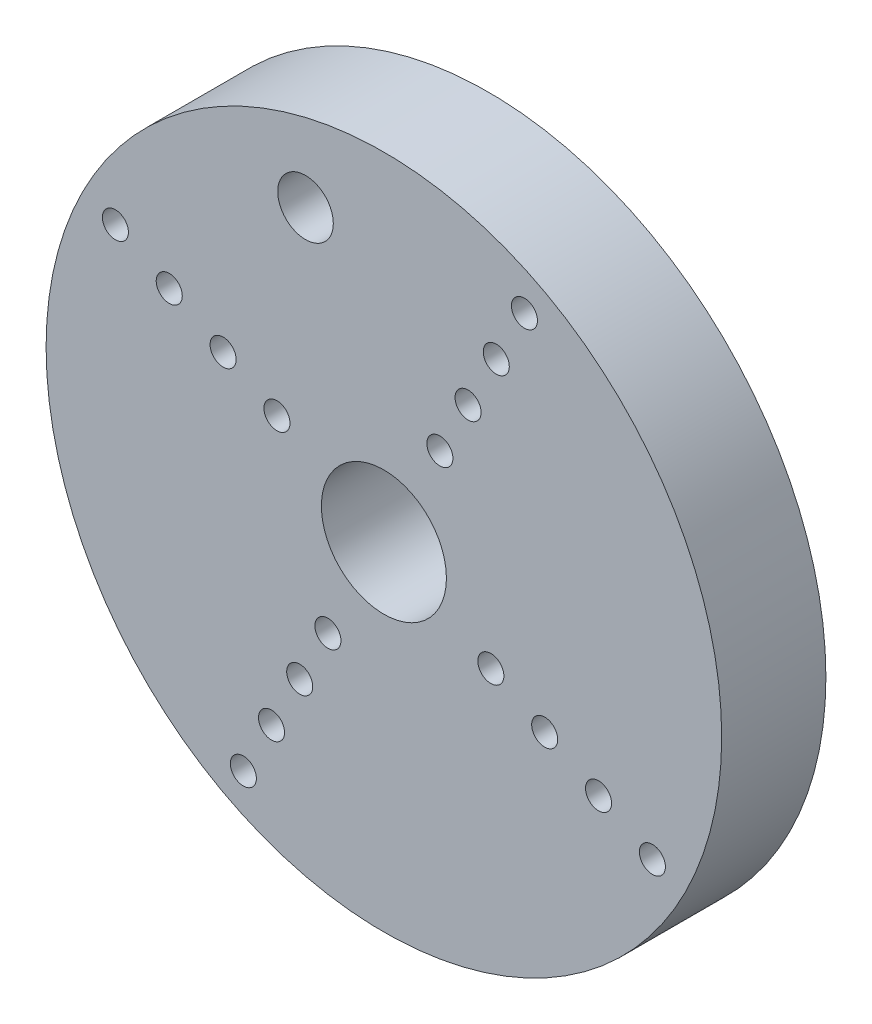
ISO-10303-21;
HEADER;
FILE_DESCRIPTION(('STEP AP214'),'2;1');
FILE_NAME('part.step','',(''),(''),'','','');
FILE_SCHEMA(('AUTOMOTIVE_DESIGN { 1 0 10303 214 1 1 1 1 }'));
ENDSEC;
DATA;
#1=APPLICATION_CONTEXT('core data for automotive mechanical design processes');
#2=APPLICATION_PROTOCOL_DEFINITION('international standard','automotive_design',2000,#1);
#3=PRODUCT_CONTEXT('',#1,'mechanical');
#4=PRODUCT('Part','Part','',(#3));
#5=PRODUCT_RELATED_PRODUCT_CATEGORY('part','',(#4));
#6=PRODUCT_DEFINITION_FORMATION('','',#4);
#7=PRODUCT_DEFINITION_CONTEXT('part definition',#1,'design');
#8=PRODUCT_DEFINITION('design','',#6,#7);
#9=PRODUCT_DEFINITION_SHAPE('','',#8);
#10=(LENGTH_UNIT() NAMED_UNIT(*) SI_UNIT(.MILLI.,.METRE.));
#11=(NAMED_UNIT(*) PLANE_ANGLE_UNIT() SI_UNIT($,.RADIAN.));
#12=(NAMED_UNIT(*) SI_UNIT($,.STERADIAN.) SOLID_ANGLE_UNIT());
#13=UNCERTAINTY_MEASURE_WITH_UNIT(LENGTH_MEASURE(1.E-05),#10,'distance_accuracy_value','');
#14=(GEOMETRIC_REPRESENTATION_CONTEXT(3) GLOBAL_UNCERTAINTY_ASSIGNED_CONTEXT((#13)) GLOBAL_UNIT_ASSIGNED_CONTEXT((#10,
#11,#12)) REPRESENTATION_CONTEXT('',''));
#15=CARTESIAN_POINT('',(0.,0.,0.));
#16=DIRECTION('',(0.,0.,1.));
#17=DIRECTION('',(1.,0.,0.));
#18=AXIS2_PLACEMENT_3D('',#15,#16,#17);
#19=CARTESIAN_POINT('',(216.229766610525,107.1388,6.));
#20=DIRECTION('',(0.,0.,1.));
#21=DIRECTION('',(1.,0.,0.));
#22=AXIS2_PLACEMENT_3D('',#19,#20,#21);
#23=PLANE('',#22);
#24=CARTESIAN_POINT('',(210.072405248433,110.36205938407,6.));
#25=DIRECTION('',(0.,0.,1.));
#26=DIRECTION('',(1.,0.,0.));
#27=AXIS2_PLACEMENT_3D('',#24,#25,#26);
#28=CIRCLE('',#27,0.750000000000012);
#29=CARTESIAN_POINT('',(210.822405248433,110.36205938407,6.));
#30=VERTEX_POINT('',#29);
#31=EDGE_CURVE('E137',#30,#30,#28,.T.);
#32=ORIENTED_EDGE('',*,*,#31,.F.);
#33=EDGE_LOOP('',(#32));
#34=FACE_BOUND('',#33,.T.);
#35=CARTESIAN_POINT('',(203.870746322606,113.608507684554,6.));
#36=DIRECTION('',(0.,0.,1.));
#37=DIRECTION('',(1.,0.,0.));
#38=AXIS2_PLACEMENT_3D('',#35,#36,#37);
#39=CIRCLE('',#38,0.750000000000004);
#40=CARTESIAN_POINT('',(204.620746322606,113.608507684554,6.));
#41=VERTEX_POINT('',#40);
#42=EDGE_CURVE('E125',#41,#41,#39,.T.);
#43=ORIENTED_EDGE('',*,*,#42,.F.);
#44=EDGE_LOOP('',(#43));
#45=FACE_BOUND('',#44,.T.);
#46=CARTESIAN_POINT('',(213.006507226435,100.981438637928,6.));
#47=DIRECTION('',(0.,0.,1.));
#48=DIRECTION('',(1.,0.,0.));
#49=AXIS2_PLACEMENT_3D('',#46,#47,#48);
#50=CIRCLE('',#49,0.750000000000008);
#51=CARTESIAN_POINT('',(213.756507226435,100.981438637928,6.));
#52=VERTEX_POINT('',#51);
#53=EDGE_CURVE('E113',#52,#52,#50,.T.);
#54=ORIENTED_EDGE('',*,*,#53,.F.);
#55=EDGE_LOOP('',(#54));
#56=FACE_BOUND('',#55,.T.);
#57=CARTESIAN_POINT('',(209.760058925952,94.7797797121017,6.));
#58=DIRECTION('',(0.,0.,1.));
#59=DIRECTION('',(1.,0.,0.));
#60=AXIS2_PLACEMENT_3D('',#57,#58,#59);
#61=CIRCLE('',#60,0.750000000000012);
#62=CARTESIAN_POINT('',(210.510058925952,94.7797797121017,6.));
#63=VERTEX_POINT('',#62);
#64=EDGE_CURVE('E101',#63,#63,#61,.T.);
#65=ORIENTED_EDGE('',*,*,#64,.F.);
#66=EDGE_LOOP('',(#65));
#67=FACE_BOUND('',#66,.T.);
#68=CARTESIAN_POINT('',(222.387127972577,103.915540615931,6.));
#69=DIRECTION('',(0.,0.,1.));
#70=DIRECTION('',(1.,0.,0.));
#71=AXIS2_PLACEMENT_3D('',#68,#69,#70);
#72=CIRCLE('',#71,0.750000000000012);
#73=CARTESIAN_POINT('',(223.137127972577,103.915540615931,6.));
#74=VERTEX_POINT('',#73);
#75=EDGE_CURVE('E89',#74,#74,#72,.T.);
#76=ORIENTED_EDGE('',*,*,#75,.F.);
#77=EDGE_LOOP('',(#76));
#78=FACE_BOUND('',#77,.T.);
#79=CARTESIAN_POINT('',(228.588786898403,100.669092315447,6.));
#80=DIRECTION('',(0.,0.,1.));
#81=DIRECTION('',(1.,0.,0.));
#82=AXIS2_PLACEMENT_3D('',#79,#80,#81);
#83=CIRCLE('',#82,0.750000000000012);
#84=CARTESIAN_POINT('',(229.338786898403,100.669092315447,6.));
#85=VERTEX_POINT('',#84);
#86=EDGE_CURVE('E77',#85,#85,#83,.T.);
#87=ORIENTED_EDGE('',*,*,#86,.F.);
#88=EDGE_LOOP('',(#87));
#89=FACE_BOUND('',#88,.T.);
#90=CARTESIAN_POINT('',(216.229766610525,107.1388,6.));
#91=DIRECTION('',(0.,0.,1.));
#92=DIRECTION('',(1.,0.,0.));
#93=AXIS2_PLACEMENT_3D('',#90,#91,#92);
#94=CIRCLE('',#93,3.59999999999242);
#95=CARTESIAN_POINT('',(219.829766610517,107.1388,6.));
#96=VERTEX_POINT('',#95);
#97=EDGE_CURVE('E65',#96,#96,#94,.T.);
#98=ORIENTED_EDGE('',*,*,#97,.F.);
#99=EDGE_LOOP('',(#98));
#100=FACE_BOUND('',#99,.T.);
#101=CARTESIAN_POINT('',(221.076250144816,116.396990824985,6.));
#102=DIRECTION('',(0.,0.,1.));
#103=DIRECTION('',(1.,0.,0.));
#104=AXIS2_PLACEMENT_3D('',#101,#102,#103);
#105=CIRCLE('',#104,0.749999999999985);
#106=CARTESIAN_POINT('',(221.826250144816,116.396990824985,6.));
#107=VERTEX_POINT('',#106);
#108=EDGE_CURVE('E53',#107,#107,#105,.T.);
#109=ORIENTED_EDGE('',*,*,#108,.F.);
#110=EDGE_LOOP('',(#109));
#111=FACE_BOUND('',#110,.T.);
#112=CARTESIAN_POINT('',(224.3226984453,122.598649750812,6.));
#113=DIRECTION('',(0.,0.,1.));
#114=DIRECTION('',(1.,0.,0.));
#115=AXIS2_PLACEMENT_3D('',#112,#113,#114);
#116=CIRCLE('',#115,0.749999999999985);
#117=CARTESIAN_POINT('',(225.0726984453,122.598649750812,6.));
#118=VERTEX_POINT('',#117);
#119=EDGE_CURVE('E42',#118,#118,#116,.T.);
#120=ORIENTED_EDGE('',*,*,#119,.F.);
#121=EDGE_LOOP('',(#120));
#122=FACE_BOUND('',#121,.T.);
#123=CARTESIAN_POINT('',(216.229766610525,107.1388,6.));
#124=DIRECTION('',(0.,0.,1.));
#125=DIRECTION('',(1.,0.,0.));
#126=AXIS2_PLACEMENT_3D('',#123,#124,#125);
#127=CIRCLE('',#126,19.44999999999);
#128=CARTESIAN_POINT('',(235.679766610515,107.1388,6.));
#129=VERTEX_POINT('',#128);
#130=EDGE_CURVE('E10',#129,#129,#127,.T.);
#131=ORIENTED_EDGE('',*,*,#130,.T.);
#132=EDGE_LOOP('',(#131));
#133=FACE_BOUND('',#132,.T.);
#134=CARTESIAN_POINT('',(222.699474295058,119.497820287899,6.));
#135=DIRECTION('',(0.,0.,1.));
#136=DIRECTION('',(1.,0.,0.));
#137=AXIS2_PLACEMENT_3D('',#134,#135,#136);
#138=CIRCLE('',#137,0.750000000000012);
#139=CARTESIAN_POINT('',(223.449474295058,119.497820287899,6.));
#140=VERTEX_POINT('',#139);
#141=EDGE_CURVE('E47',#140,#140,#138,.T.);
#142=ORIENTED_EDGE('',*,*,#141,.F.);
#143=EDGE_LOOP('',(#142));
#144=FACE_BOUND('',#143,.T.);
#145=CARTESIAN_POINT('',(219.453025994575,113.296161362072,6.));
#146=DIRECTION('',(0.,0.,1.));
#147=DIRECTION('',(1.,0.,0.));
#148=AXIS2_PLACEMENT_3D('',#145,#146,#147);
#149=CIRCLE('',#148,0.750000000000012);
#150=CARTESIAN_POINT('',(220.203025994575,113.296161362072,6.));
#151=VERTEX_POINT('',#150);
#152=EDGE_CURVE('E59',#151,#151,#149,.T.);
#153=ORIENTED_EDGE('',*,*,#152,.F.);
#154=EDGE_LOOP('',(#153));
#155=FACE_BOUND('',#154,.T.);
#156=CARTESIAN_POINT('',(231.689616361317,99.0458681652051,6.));
#157=DIRECTION('',(0.,0.,1.));
#158=DIRECTION('',(1.,0.,0.));
#159=AXIS2_PLACEMENT_3D('',#156,#157,#158);
#160=CIRCLE('',#159,0.749999999999985);
#161=CARTESIAN_POINT('',(232.439616361317,99.0458681652051,6.));
#162=VERTEX_POINT('',#161);
#163=EDGE_CURVE('E71',#162,#162,#160,.T.);
#164=ORIENTED_EDGE('',*,*,#163,.F.);
#165=EDGE_LOOP('',(#164));
#166=FACE_BOUND('',#165,.T.);
#167=CARTESIAN_POINT('',(225.48795743549,102.292316465689,6.));
#168=DIRECTION('',(0.,0.,1.));
#169=DIRECTION('',(1.,0.,0.));
#170=AXIS2_PLACEMENT_3D('',#167,#168,#169);
#171=CIRCLE('',#170,0.749999999999985);
#172=CARTESIAN_POINT('',(226.23795743549,102.292316465689,6.));
#173=VERTEX_POINT('',#172);
#174=EDGE_CURVE('E83',#173,#173,#171,.T.);
#175=ORIENTED_EDGE('',*,*,#174,.F.);
#176=EDGE_LOOP('',(#175));
#177=FACE_BOUND('',#176,.T.);
#178=CARTESIAN_POINT('',(208.13683477571,91.6789502491883,6.));
#179=DIRECTION('',(0.,0.,1.));
#180=DIRECTION('',(1.,0.,0.));
#181=AXIS2_PLACEMENT_3D('',#178,#179,#180);
#182=CIRCLE('',#181,0.749999999999985);
#183=CARTESIAN_POINT('',(208.88683477571,91.6789502491883,6.));
#184=VERTEX_POINT('',#183);
#185=EDGE_CURVE('E95',#184,#184,#182,.T.);
#186=ORIENTED_EDGE('',*,*,#185,.F.);
#187=EDGE_LOOP('',(#186));
#188=FACE_BOUND('',#187,.T.);
#189=CARTESIAN_POINT('',(211.383283076193,97.8806091750151,6.));
#190=DIRECTION('',(0.,0.,1.));
#191=DIRECTION('',(1.,0.,0.));
#192=AXIS2_PLACEMENT_3D('',#189,#190,#191);
#193=CIRCLE('',#192,0.749999999999981);
#194=CARTESIAN_POINT('',(212.133283076193,97.8806091750151,6.));
#195=VERTEX_POINT('',#194);
#196=EDGE_CURVE('E107',#195,#195,#193,.T.);
#197=ORIENTED_EDGE('',*,*,#196,.F.);
#198=EDGE_LOOP('',(#197));
#199=FACE_BOUND('',#198,.T.);
#200=CARTESIAN_POINT('',(200.769916859693,115.231731834795,6.));
#201=DIRECTION('',(0.,0.,1.));
#202=DIRECTION('',(1.,0.,0.));
#203=AXIS2_PLACEMENT_3D('',#200,#201,#202);
#204=CIRCLE('',#203,0.749999999999985);
#205=CARTESIAN_POINT('',(201.519916859693,115.231731834795,6.));
#206=VERTEX_POINT('',#205);
#207=EDGE_CURVE('E119',#206,#206,#204,.T.);
#208=ORIENTED_EDGE('',*,*,#207,.F.);
#209=EDGE_LOOP('',(#208));
#210=FACE_BOUND('',#209,.T.);
#211=CARTESIAN_POINT('',(206.97157578552,111.985283534312,6.));
#212=DIRECTION('',(0.,0.,1.));
#213=DIRECTION('',(1.,0.,0.));
#214=AXIS2_PLACEMENT_3D('',#211,#212,#213);
#215=CIRCLE('',#214,0.749999999999985);
#216=CARTESIAN_POINT('',(207.72157578552,111.985283534312,6.));
#217=VERTEX_POINT('',#216);
#218=EDGE_CURVE('E131',#217,#217,#215,.T.);
#219=ORIENTED_EDGE('',*,*,#218,.F.);
#220=EDGE_LOOP('',(#219));
#221=FACE_BOUND('',#220,.T.);
#222=CARTESIAN_POINT('',(211.717350559252,121.565450451402,6.));
#223=DIRECTION('',(0.,0.,1.));
#224=DIRECTION('',(1.,0.,0.));
#225=AXIS2_PLACEMENT_3D('',#222,#223,#224);
#226=CIRCLE('',#225,1.59999997499998);
#227=CARTESIAN_POINT('',(213.317350534252,121.565450451402,6.));
#228=VERTEX_POINT('',#227);
#229=EDGE_CURVE('E143',#228,#228,#226,.T.);
#230=ORIENTED_EDGE('',*,*,#229,.F.);
#231=EDGE_LOOP('',(#230));
#232=FACE_BOUND('',#231,.T.);
#233=ADVANCED_FACE('F31',(#34,#45,#56,#67,#78,#89,#100,#111,#122,#133,#144,#155,#166,#177,#188,
#199,#210,#221,#232),#23,.T.);
#234=CARTESIAN_POINT('',(216.229766610525,107.1388,0.));
#235=DIRECTION('',(0.,0.,1.));
#236=DIRECTION('',(1.,0.,0.));
#237=AXIS2_PLACEMENT_3D('',#234,#235,#236);
#238=PLANE('',#237);
#239=CARTESIAN_POINT('',(216.229766610525,107.1388,0.));
#240=DIRECTION('',(0.,0.,1.));
#241=DIRECTION('',(1.,0.,0.));
#242=AXIS2_PLACEMENT_3D('',#239,#240,#241);
#243=CIRCLE('',#242,19.44999999999);
#244=CARTESIAN_POINT('',(235.679766610515,107.1388,0.));
#245=VERTEX_POINT('',#244);
#246=EDGE_CURVE('E35',#245,#245,#243,.T.);
#247=ORIENTED_EDGE('',*,*,#246,.F.);
#248=EDGE_LOOP('',(#247));
#249=FACE_BOUND('',#248,.T.);
#250=CARTESIAN_POINT('',(224.3226984453,122.598649750812,0.));
#251=DIRECTION('',(0.,0.,1.));
#252=DIRECTION('',(1.,0.,0.));
#253=AXIS2_PLACEMENT_3D('',#250,#251,#252);
#254=CIRCLE('',#253,0.749999999999985);
#255=CARTESIAN_POINT('',(225.0726984453,122.598649750812,0.));
#256=VERTEX_POINT('',#255);
#257=EDGE_CURVE('E44',#256,#256,#254,.T.);
#258=ORIENTED_EDGE('',*,*,#257,.T.);
#259=EDGE_LOOP('',(#258));
#260=FACE_BOUND('',#259,.T.);
#261=CARTESIAN_POINT('',(222.699474295058,119.497820287899,0.));
#262=DIRECTION('',(0.,0.,1.));
#263=DIRECTION('',(1.,0.,0.));
#264=AXIS2_PLACEMENT_3D('',#261,#262,#263);
#265=CIRCLE('',#264,0.750000000000012);
#266=CARTESIAN_POINT('',(223.449474295058,119.497820287899,0.));
#267=VERTEX_POINT('',#266);
#268=EDGE_CURVE('E50',#267,#267,#265,.T.);
#269=ORIENTED_EDGE('',*,*,#268,.T.);
#270=EDGE_LOOP('',(#269));
#271=FACE_BOUND('',#270,.T.);
#272=CARTESIAN_POINT('',(221.076250144816,116.396990824985,0.));
#273=DIRECTION('',(0.,0.,1.));
#274=DIRECTION('',(1.,0.,0.));
#275=AXIS2_PLACEMENT_3D('',#272,#273,#274);
#276=CIRCLE('',#275,0.749999999999985);
#277=CARTESIAN_POINT('',(221.826250144816,116.396990824985,0.));
#278=VERTEX_POINT('',#277);
#279=EDGE_CURVE('E56',#278,#278,#276,.T.);
#280=ORIENTED_EDGE('',*,*,#279,.T.);
#281=EDGE_LOOP('',(#280));
#282=FACE_BOUND('',#281,.T.);
#283=CARTESIAN_POINT('',(219.453025994575,113.296161362072,0.));
#284=DIRECTION('',(0.,0.,1.));
#285=DIRECTION('',(1.,0.,0.));
#286=AXIS2_PLACEMENT_3D('',#283,#284,#285);
#287=CIRCLE('',#286,0.750000000000012);
#288=CARTESIAN_POINT('',(220.203025994575,113.296161362072,0.));
#289=VERTEX_POINT('',#288);
#290=EDGE_CURVE('E62',#289,#289,#287,.T.);
#291=ORIENTED_EDGE('',*,*,#290,.T.);
#292=EDGE_LOOP('',(#291));
#293=FACE_BOUND('',#292,.T.);
#294=CARTESIAN_POINT('',(216.229766610525,107.1388,0.));
#295=DIRECTION('',(0.,0.,1.));
#296=DIRECTION('',(1.,0.,0.));
#297=AXIS2_PLACEMENT_3D('',#294,#295,#296);
#298=CIRCLE('',#297,3.59999999999242);
#299=CARTESIAN_POINT('',(219.829766610517,107.1388,0.));
#300=VERTEX_POINT('',#299);
#301=EDGE_CURVE('E68',#300,#300,#298,.T.);
#302=ORIENTED_EDGE('',*,*,#301,.T.);
#303=EDGE_LOOP('',(#302));
#304=FACE_BOUND('',#303,.T.);
#305=CARTESIAN_POINT('',(231.689616361317,99.0458681652051,0.));
#306=DIRECTION('',(0.,0.,1.));
#307=DIRECTION('',(1.,0.,0.));
#308=AXIS2_PLACEMENT_3D('',#305,#306,#307);
#309=CIRCLE('',#308,0.749999999999985);
#310=CARTESIAN_POINT('',(232.439616361317,99.0458681652051,0.));
#311=VERTEX_POINT('',#310);
#312=EDGE_CURVE('E74',#311,#311,#309,.T.);
#313=ORIENTED_EDGE('',*,*,#312,.T.);
#314=EDGE_LOOP('',(#313));
#315=FACE_BOUND('',#314,.T.);
#316=CARTESIAN_POINT('',(228.588786898403,100.669092315447,0.));
#317=DIRECTION('',(0.,0.,1.));
#318=DIRECTION('',(1.,0.,0.));
#319=AXIS2_PLACEMENT_3D('',#316,#317,#318);
#320=CIRCLE('',#319,0.750000000000012);
#321=CARTESIAN_POINT('',(229.338786898403,100.669092315447,0.));
#322=VERTEX_POINT('',#321);
#323=EDGE_CURVE('E80',#322,#322,#320,.T.);
#324=ORIENTED_EDGE('',*,*,#323,.T.);
#325=EDGE_LOOP('',(#324));
#326=FACE_BOUND('',#325,.T.);
#327=CARTESIAN_POINT('',(225.48795743549,102.292316465689,0.));
#328=DIRECTION('',(0.,0.,1.));
#329=DIRECTION('',(1.,0.,0.));
#330=AXIS2_PLACEMENT_3D('',#327,#328,#329);
#331=CIRCLE('',#330,0.749999999999985);
#332=CARTESIAN_POINT('',(226.23795743549,102.292316465689,0.));
#333=VERTEX_POINT('',#332);
#334=EDGE_CURVE('E86',#333,#333,#331,.T.);
#335=ORIENTED_EDGE('',*,*,#334,.T.);
#336=EDGE_LOOP('',(#335));
#337=FACE_BOUND('',#336,.T.);
#338=CARTESIAN_POINT('',(222.387127972577,103.915540615931,0.));
#339=DIRECTION('',(0.,0.,1.));
#340=DIRECTION('',(1.,0.,0.));
#341=AXIS2_PLACEMENT_3D('',#338,#339,#340);
#342=CIRCLE('',#341,0.750000000000012);
#343=CARTESIAN_POINT('',(223.137127972577,103.915540615931,0.));
#344=VERTEX_POINT('',#343);
#345=EDGE_CURVE('E92',#344,#344,#342,.T.);
#346=ORIENTED_EDGE('',*,*,#345,.T.);
#347=EDGE_LOOP('',(#346));
#348=FACE_BOUND('',#347,.T.);
#349=CARTESIAN_POINT('',(208.13683477571,91.6789502491883,0.));
#350=DIRECTION('',(0.,0.,1.));
#351=DIRECTION('',(1.,0.,0.));
#352=AXIS2_PLACEMENT_3D('',#349,#350,#351);
#353=CIRCLE('',#352,0.749999999999985);
#354=CARTESIAN_POINT('',(208.88683477571,91.6789502491883,0.));
#355=VERTEX_POINT('',#354);
#356=EDGE_CURVE('E98',#355,#355,#353,.T.);
#357=ORIENTED_EDGE('',*,*,#356,.T.);
#358=EDGE_LOOP('',(#357));
#359=FACE_BOUND('',#358,.T.);
#360=CARTESIAN_POINT('',(209.760058925952,94.7797797121017,0.));
#361=DIRECTION('',(0.,0.,1.));
#362=DIRECTION('',(1.,0.,0.));
#363=AXIS2_PLACEMENT_3D('',#360,#361,#362);
#364=CIRCLE('',#363,0.750000000000012);
#365=CARTESIAN_POINT('',(210.510058925952,94.7797797121017,0.));
#366=VERTEX_POINT('',#365);
#367=EDGE_CURVE('E104',#366,#366,#364,.T.);
#368=ORIENTED_EDGE('',*,*,#367,.T.);
#369=EDGE_LOOP('',(#368));
#370=FACE_BOUND('',#369,.T.);
#371=CARTESIAN_POINT('',(211.383283076193,97.8806091750151,0.));
#372=DIRECTION('',(0.,0.,1.));
#373=DIRECTION('',(1.,0.,0.));
#374=AXIS2_PLACEMENT_3D('',#371,#372,#373);
#375=CIRCLE('',#374,0.749999999999981);
#376=CARTESIAN_POINT('',(212.133283076193,97.8806091750151,0.));
#377=VERTEX_POINT('',#376);
#378=EDGE_CURVE('E110',#377,#377,#375,.T.);
#379=ORIENTED_EDGE('',*,*,#378,.T.);
#380=EDGE_LOOP('',(#379));
#381=FACE_BOUND('',#380,.T.);
#382=CARTESIAN_POINT('',(213.006507226435,100.981438637928,0.));
#383=DIRECTION('',(0.,0.,1.));
#384=DIRECTION('',(1.,0.,0.));
#385=AXIS2_PLACEMENT_3D('',#382,#383,#384);
#386=CIRCLE('',#385,0.750000000000008);
#387=CARTESIAN_POINT('',(213.756507226435,100.981438637928,0.));
#388=VERTEX_POINT('',#387);
#389=EDGE_CURVE('E116',#388,#388,#386,.T.);
#390=ORIENTED_EDGE('',*,*,#389,.T.);
#391=EDGE_LOOP('',(#390));
#392=FACE_BOUND('',#391,.T.);
#393=CARTESIAN_POINT('',(200.769916859693,115.231731834795,0.));
#394=DIRECTION('',(0.,0.,1.));
#395=DIRECTION('',(1.,0.,0.));
#396=AXIS2_PLACEMENT_3D('',#393,#394,#395);
#397=CIRCLE('',#396,0.749999999999985);
#398=CARTESIAN_POINT('',(201.519916859693,115.231731834795,0.));
#399=VERTEX_POINT('',#398);
#400=EDGE_CURVE('E122',#399,#399,#397,.T.);
#401=ORIENTED_EDGE('',*,*,#400,.T.);
#402=EDGE_LOOP('',(#401));
#403=FACE_BOUND('',#402,.T.);
#404=CARTESIAN_POINT('',(203.870746322606,113.608507684554,0.));
#405=DIRECTION('',(0.,0.,1.));
#406=DIRECTION('',(1.,0.,0.));
#407=AXIS2_PLACEMENT_3D('',#404,#405,#406);
#408=CIRCLE('',#407,0.750000000000004);
#409=CARTESIAN_POINT('',(204.620746322606,113.608507684554,0.));
#410=VERTEX_POINT('',#409);
#411=EDGE_CURVE('E128',#410,#410,#408,.T.);
#412=ORIENTED_EDGE('',*,*,#411,.T.);
#413=EDGE_LOOP('',(#412));
#414=FACE_BOUND('',#413,.T.);
#415=CARTESIAN_POINT('',(206.97157578552,111.985283534312,0.));
#416=DIRECTION('',(0.,0.,1.));
#417=DIRECTION('',(1.,0.,0.));
#418=AXIS2_PLACEMENT_3D('',#415,#416,#417);
#419=CIRCLE('',#418,0.749999999999985);
#420=CARTESIAN_POINT('',(207.72157578552,111.985283534312,0.));
#421=VERTEX_POINT('',#420);
#422=EDGE_CURVE('E134',#421,#421,#419,.T.);
#423=ORIENTED_EDGE('',*,*,#422,.T.);
#424=EDGE_LOOP('',(#423));
#425=FACE_BOUND('',#424,.T.);
#426=CARTESIAN_POINT('',(210.072405248433,110.36205938407,0.));
#427=DIRECTION('',(0.,0.,1.));
#428=DIRECTION('',(1.,0.,0.));
#429=AXIS2_PLACEMENT_3D('',#426,#427,#428);
#430=CIRCLE('',#429,0.750000000000012);
#431=CARTESIAN_POINT('',(210.822405248433,110.36205938407,0.));
#432=VERTEX_POINT('',#431);
#433=EDGE_CURVE('E140',#432,#432,#430,.T.);
#434=ORIENTED_EDGE('',*,*,#433,.T.);
#435=EDGE_LOOP('',(#434));
#436=FACE_BOUND('',#435,.T.);
#437=CARTESIAN_POINT('',(211.717350559252,121.565450451402,0.));
#438=DIRECTION('',(0.,0.,1.));
#439=DIRECTION('',(1.,0.,0.));
#440=AXIS2_PLACEMENT_3D('',#437,#438,#439);
#441=CIRCLE('',#440,1.59999997499998);
#442=CARTESIAN_POINT('',(213.317350534252,121.565450451402,0.));
#443=VERTEX_POINT('',#442);
#444=EDGE_CURVE('E146',#443,#443,#441,.T.);
#445=ORIENTED_EDGE('',*,*,#444,.T.);
#446=EDGE_LOOP('',(#445));
#447=FACE_BOUND('',#446,.T.);
#448=ADVANCED_FACE('F156',(#249,#260,#271,#282,#293,#304,#315,#326,#337,#348,#359,#370,#381,
#392,#403,#414,#425,#436,#447),#238,.F.);
#449=CARTESIAN_POINT('',(216.229766610525,107.1388,6.));
#450=DIRECTION('',(0.,0.,-1.));
#451=DIRECTION('',(-1.,0.,0.));
#452=AXIS2_PLACEMENT_3D('',#449,#450,#451);
#453=CYLINDRICAL_SURFACE('',#452,19.44999999999);
#454=ORIENTED_EDGE('',*,*,#130,.F.);
#455=EDGE_LOOP('',(#454));
#456=FACE_BOUND('',#455,.T.);
#457=ORIENTED_EDGE('',*,*,#246,.T.);
#458=EDGE_LOOP('',(#457));
#459=FACE_BOUND('',#458,.T.);
#460=ADVANCED_FACE('F33',(#456,#459),#453,.T.);
#461=CARTESIAN_POINT('',(224.3226984453,122.598649750812,6.));
#462=DIRECTION('',(0.,0.,-1.));
#463=DIRECTION('',(-1.,0.,0.));
#464=AXIS2_PLACEMENT_3D('',#461,#462,#463);
#465=CYLINDRICAL_SURFACE('',#464,0.749999999999985);
#466=ORIENTED_EDGE('',*,*,#119,.T.);
#467=EDGE_LOOP('',(#466));
#468=FACE_BOUND('',#467,.T.);
#469=ORIENTED_EDGE('',*,*,#257,.F.);
#470=EDGE_LOOP('',(#469));
#471=FACE_BOUND('',#470,.T.);
#472=ADVANCED_FACE('F166',(#468,#471),#465,.F.);
#473=CARTESIAN_POINT('',(222.699474295058,119.497820287899,6.));
#474=DIRECTION('',(0.,0.,-1.));
#475=DIRECTION('',(-1.,0.,0.));
#476=AXIS2_PLACEMENT_3D('',#473,#474,#475);
#477=CYLINDRICAL_SURFACE('',#476,0.750000000000012);
#478=ORIENTED_EDGE('',*,*,#141,.T.);
#479=EDGE_LOOP('',(#478));
#480=FACE_BOUND('',#479,.T.);
#481=ORIENTED_EDGE('',*,*,#268,.F.);
#482=EDGE_LOOP('',(#481));
#483=FACE_BOUND('',#482,.T.);
#484=ADVANCED_FACE('F169',(#480,#483),#477,.F.);
#485=CARTESIAN_POINT('',(221.076250144816,116.396990824985,6.));
#486=DIRECTION('',(0.,0.,-1.));
#487=DIRECTION('',(-1.,0.,0.));
#488=AXIS2_PLACEMENT_3D('',#485,#486,#487);
#489=CYLINDRICAL_SURFACE('',#488,0.749999999999985);
#490=ORIENTED_EDGE('',*,*,#108,.T.);
#491=EDGE_LOOP('',(#490));
#492=FACE_BOUND('',#491,.T.);
#493=ORIENTED_EDGE('',*,*,#279,.F.);
#494=EDGE_LOOP('',(#493));
#495=FACE_BOUND('',#494,.T.);
#496=ADVANCED_FACE('F173',(#492,#495),#489,.F.);
#497=CARTESIAN_POINT('',(219.453025994575,113.296161362072,6.));
#498=DIRECTION('',(0.,0.,-1.));
#499=DIRECTION('',(-1.,0.,0.));
#500=AXIS2_PLACEMENT_3D('',#497,#498,#499);
#501=CYLINDRICAL_SURFACE('',#500,0.750000000000012);
#502=ORIENTED_EDGE('',*,*,#152,.T.);
#503=EDGE_LOOP('',(#502));
#504=FACE_BOUND('',#503,.T.);
#505=ORIENTED_EDGE('',*,*,#290,.F.);
#506=EDGE_LOOP('',(#505));
#507=FACE_BOUND('',#506,.T.);
#508=ADVANCED_FACE('F177',(#504,#507),#501,.F.);
#509=CARTESIAN_POINT('',(216.229766610525,107.1388,6.));
#510=DIRECTION('',(0.,0.,-1.));
#511=DIRECTION('',(-1.,0.,0.));
#512=AXIS2_PLACEMENT_3D('',#509,#510,#511);
#513=CYLINDRICAL_SURFACE('',#512,3.59999999999242);
#514=ORIENTED_EDGE('',*,*,#97,.T.);
#515=EDGE_LOOP('',(#514));
#516=FACE_BOUND('',#515,.T.);
#517=ORIENTED_EDGE('',*,*,#301,.F.);
#518=EDGE_LOOP('',(#517));
#519=FACE_BOUND('',#518,.T.);
#520=ADVANCED_FACE('F181',(#516,#519),#513,.F.);
#521=CARTESIAN_POINT('',(231.689616361317,99.0458681652051,6.));
#522=DIRECTION('',(0.,0.,-1.));
#523=DIRECTION('',(-1.,0.,0.));
#524=AXIS2_PLACEMENT_3D('',#521,#522,#523);
#525=CYLINDRICAL_SURFACE('',#524,0.749999999999985);
#526=ORIENTED_EDGE('',*,*,#163,.T.);
#527=EDGE_LOOP('',(#526));
#528=FACE_BOUND('',#527,.T.);
#529=ORIENTED_EDGE('',*,*,#312,.F.);
#530=EDGE_LOOP('',(#529));
#531=FACE_BOUND('',#530,.T.);
#532=ADVANCED_FACE('F185',(#528,#531),#525,.F.);
#533=CARTESIAN_POINT('',(228.588786898403,100.669092315447,6.));
#534=DIRECTION('',(0.,0.,-1.));
#535=DIRECTION('',(-1.,0.,0.));
#536=AXIS2_PLACEMENT_3D('',#533,#534,#535);
#537=CYLINDRICAL_SURFACE('',#536,0.750000000000012);
#538=ORIENTED_EDGE('',*,*,#86,.T.);
#539=EDGE_LOOP('',(#538));
#540=FACE_BOUND('',#539,.T.);
#541=ORIENTED_EDGE('',*,*,#323,.F.);
#542=EDGE_LOOP('',(#541));
#543=FACE_BOUND('',#542,.T.);
#544=ADVANCED_FACE('F189',(#540,#543),#537,.F.);
#545=CARTESIAN_POINT('',(225.48795743549,102.292316465689,6.));
#546=DIRECTION('',(0.,0.,-1.));
#547=DIRECTION('',(-1.,0.,0.));
#548=AXIS2_PLACEMENT_3D('',#545,#546,#547);
#549=CYLINDRICAL_SURFACE('',#548,0.749999999999985);
#550=ORIENTED_EDGE('',*,*,#174,.T.);
#551=EDGE_LOOP('',(#550));
#552=FACE_BOUND('',#551,.T.);
#553=ORIENTED_EDGE('',*,*,#334,.F.);
#554=EDGE_LOOP('',(#553));
#555=FACE_BOUND('',#554,.T.);
#556=ADVANCED_FACE('F193',(#552,#555),#549,.F.);
#557=CARTESIAN_POINT('',(222.387127972577,103.915540615931,6.));
#558=DIRECTION('',(0.,0.,-1.));
#559=DIRECTION('',(-1.,0.,0.));
#560=AXIS2_PLACEMENT_3D('',#557,#558,#559);
#561=CYLINDRICAL_SURFACE('',#560,0.750000000000012);
#562=ORIENTED_EDGE('',*,*,#75,.T.);
#563=EDGE_LOOP('',(#562));
#564=FACE_BOUND('',#563,.T.);
#565=ORIENTED_EDGE('',*,*,#345,.F.);
#566=EDGE_LOOP('',(#565));
#567=FACE_BOUND('',#566,.T.);
#568=ADVANCED_FACE('F197',(#564,#567),#561,.F.);
#569=CARTESIAN_POINT('',(208.13683477571,91.6789502491883,6.));
#570=DIRECTION('',(0.,0.,-1.));
#571=DIRECTION('',(-1.,0.,0.));
#572=AXIS2_PLACEMENT_3D('',#569,#570,#571);
#573=CYLINDRICAL_SURFACE('',#572,0.749999999999985);
#574=ORIENTED_EDGE('',*,*,#185,.T.);
#575=EDGE_LOOP('',(#574));
#576=FACE_BOUND('',#575,.T.);
#577=ORIENTED_EDGE('',*,*,#356,.F.);
#578=EDGE_LOOP('',(#577));
#579=FACE_BOUND('',#578,.T.);
#580=ADVANCED_FACE('F201',(#576,#579),#573,.F.);
#581=CARTESIAN_POINT('',(209.760058925952,94.7797797121017,6.));
#582=DIRECTION('',(0.,0.,-1.));
#583=DIRECTION('',(-1.,0.,0.));
#584=AXIS2_PLACEMENT_3D('',#581,#582,#583);
#585=CYLINDRICAL_SURFACE('',#584,0.750000000000012);
#586=ORIENTED_EDGE('',*,*,#64,.T.);
#587=EDGE_LOOP('',(#586));
#588=FACE_BOUND('',#587,.T.);
#589=ORIENTED_EDGE('',*,*,#367,.F.);
#590=EDGE_LOOP('',(#589));
#591=FACE_BOUND('',#590,.T.);
#592=ADVANCED_FACE('F205',(#588,#591),#585,.F.);
#593=CARTESIAN_POINT('',(211.383283076193,97.8806091750151,6.));
#594=DIRECTION('',(0.,0.,-1.));
#595=DIRECTION('',(-1.,0.,0.));
#596=AXIS2_PLACEMENT_3D('',#593,#594,#595);
#597=CYLINDRICAL_SURFACE('',#596,0.749999999999981);
#598=ORIENTED_EDGE('',*,*,#196,.T.);
#599=EDGE_LOOP('',(#598));
#600=FACE_BOUND('',#599,.T.);
#601=ORIENTED_EDGE('',*,*,#378,.F.);
#602=EDGE_LOOP('',(#601));
#603=FACE_BOUND('',#602,.T.);
#604=ADVANCED_FACE('F209',(#600,#603),#597,.F.);
#605=CARTESIAN_POINT('',(213.006507226435,100.981438637928,6.));
#606=DIRECTION('',(0.,0.,-1.));
#607=DIRECTION('',(-1.,0.,0.));
#608=AXIS2_PLACEMENT_3D('',#605,#606,#607);
#609=CYLINDRICAL_SURFACE('',#608,0.750000000000008);
#610=ORIENTED_EDGE('',*,*,#53,.T.);
#611=EDGE_LOOP('',(#610));
#612=FACE_BOUND('',#611,.T.);
#613=ORIENTED_EDGE('',*,*,#389,.F.);
#614=EDGE_LOOP('',(#613));
#615=FACE_BOUND('',#614,.T.);
#616=ADVANCED_FACE('F213',(#612,#615),#609,.F.);
#617=CARTESIAN_POINT('',(200.769916859693,115.231731834795,6.));
#618=DIRECTION('',(0.,0.,-1.));
#619=DIRECTION('',(-1.,0.,0.));
#620=AXIS2_PLACEMENT_3D('',#617,#618,#619);
#621=CYLINDRICAL_SURFACE('',#620,0.749999999999985);
#622=ORIENTED_EDGE('',*,*,#207,.T.);
#623=EDGE_LOOP('',(#622));
#624=FACE_BOUND('',#623,.T.);
#625=ORIENTED_EDGE('',*,*,#400,.F.);
#626=EDGE_LOOP('',(#625));
#627=FACE_BOUND('',#626,.T.);
#628=ADVANCED_FACE('F217',(#624,#627),#621,.F.);
#629=CARTESIAN_POINT('',(203.870746322606,113.608507684554,6.));
#630=DIRECTION('',(0.,0.,-1.));
#631=DIRECTION('',(-1.,0.,0.));
#632=AXIS2_PLACEMENT_3D('',#629,#630,#631);
#633=CYLINDRICAL_SURFACE('',#632,0.750000000000004);
#634=ORIENTED_EDGE('',*,*,#42,.T.);
#635=EDGE_LOOP('',(#634));
#636=FACE_BOUND('',#635,.T.);
#637=ORIENTED_EDGE('',*,*,#411,.F.);
#638=EDGE_LOOP('',(#637));
#639=FACE_BOUND('',#638,.T.);
#640=ADVANCED_FACE('F221',(#636,#639),#633,.F.);
#641=CARTESIAN_POINT('',(206.97157578552,111.985283534312,6.));
#642=DIRECTION('',(0.,0.,-1.));
#643=DIRECTION('',(-1.,0.,0.));
#644=AXIS2_PLACEMENT_3D('',#641,#642,#643);
#645=CYLINDRICAL_SURFACE('',#644,0.749999999999985);
#646=ORIENTED_EDGE('',*,*,#218,.T.);
#647=EDGE_LOOP('',(#646));
#648=FACE_BOUND('',#647,.T.);
#649=ORIENTED_EDGE('',*,*,#422,.F.);
#650=EDGE_LOOP('',(#649));
#651=FACE_BOUND('',#650,.T.);
#652=ADVANCED_FACE('F225',(#648,#651),#645,.F.);
#653=CARTESIAN_POINT('',(210.072405248433,110.36205938407,6.));
#654=DIRECTION('',(0.,0.,-1.));
#655=DIRECTION('',(-1.,0.,0.));
#656=AXIS2_PLACEMENT_3D('',#653,#654,#655);
#657=CYLINDRICAL_SURFACE('',#656,0.750000000000012);
#658=ORIENTED_EDGE('',*,*,#31,.T.);
#659=EDGE_LOOP('',(#658));
#660=FACE_BOUND('',#659,.T.);
#661=ORIENTED_EDGE('',*,*,#433,.F.);
#662=EDGE_LOOP('',(#661));
#663=FACE_BOUND('',#662,.T.);
#664=ADVANCED_FACE('F229',(#660,#663),#657,.F.);
#665=CARTESIAN_POINT('',(211.717350559252,121.565450451402,6.));
#666=DIRECTION('',(0.,0.,-1.));
#667=DIRECTION('',(-1.,0.,0.));
#668=AXIS2_PLACEMENT_3D('',#665,#666,#667);
#669=CYLINDRICAL_SURFACE('',#668,1.59999997499998);
#670=ORIENTED_EDGE('',*,*,#229,.T.);
#671=EDGE_LOOP('',(#670));
#672=FACE_BOUND('',#671,.T.);
#673=ORIENTED_EDGE('',*,*,#444,.F.);
#674=EDGE_LOOP('',(#673));
#675=FACE_BOUND('',#674,.T.);
#676=ADVANCED_FACE('F152',(#672,#675),#669,.F.);
#677=CLOSED_SHELL('',(#233,#448,#460,#472,#484,#496,#508,#520,#532,#544,#556,#568,#580,#592,
#604,#616,#628,#640,#652,#664,#676));
#678=MANIFOLD_SOLID_BREP('B2',#677);
#679=ADVANCED_BREP_SHAPE_REPRESENTATION('',(#18,#678),#14);
#680=SHAPE_DEFINITION_REPRESENTATION(#9,#679);
ENDSEC;
END-ISO-10303-21;
